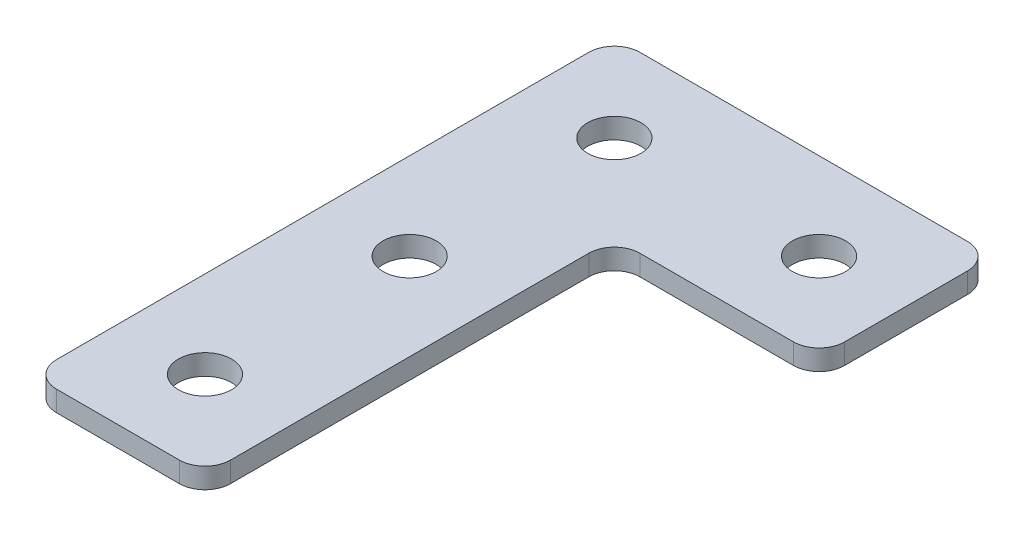
ISO-10303-21;
HEADER;
FILE_DESCRIPTION(('STEP AP214'),'2;1');
FILE_NAME('part.step','',(''),(''),'','','');
FILE_SCHEMA(('AUTOMOTIVE_DESIGN { 1 0 10303 214 1 1 1 1 }'));
ENDSEC;
DATA;
#1=APPLICATION_CONTEXT('core data for automotive mechanical design processes');
#2=APPLICATION_PROTOCOL_DEFINITION('international standard','automotive_design',2000,#1);
#3=PRODUCT_CONTEXT('',#1,'mechanical');
#4=PRODUCT('Part','Part','',(#3));
#5=PRODUCT_RELATED_PRODUCT_CATEGORY('part','',(#4));
#6=PRODUCT_DEFINITION_FORMATION('','',#4);
#7=PRODUCT_DEFINITION_CONTEXT('part definition',#1,'design');
#8=PRODUCT_DEFINITION('design','',#6,#7);
#9=PRODUCT_DEFINITION_SHAPE('','',#8);
#10=(LENGTH_UNIT() NAMED_UNIT(*) SI_UNIT(.MILLI.,.METRE.));
#11=(NAMED_UNIT(*) PLANE_ANGLE_UNIT() SI_UNIT($,.RADIAN.));
#12=(NAMED_UNIT(*) SI_UNIT($,.STERADIAN.) SOLID_ANGLE_UNIT());
#13=UNCERTAINTY_MEASURE_WITH_UNIT(LENGTH_MEASURE(1.E-05),#10,'distance_accuracy_value','');
#14=(GEOMETRIC_REPRESENTATION_CONTEXT(3) GLOBAL_UNCERTAINTY_ASSIGNED_CONTEXT((#13)) GLOBAL_UNIT_ASSIGNED_CONTEXT((#10,
#11,#12)) REPRESENTATION_CONTEXT('',''));
#15=CARTESIAN_POINT('',(0.,0.,0.));
#16=DIRECTION('',(0.,0.,1.));
#17=DIRECTION('',(1.,0.,0.));
#18=AXIS2_PLACEMENT_3D('',#15,#16,#17);
#19=CARTESIAN_POINT('',(-11.561814607669,1.92462627726309,-21.3623363744272));
#20=DIRECTION('',(0.,-1.,0.));
#21=DIRECTION('',(0.,0.,-1.));
#22=AXIS2_PLACEMENT_3D('',#19,#20,#21);
#23=PLANE('',#22);
#24=CARTESIAN_POINT('',(-11.561814607669,1.92462627726309,18.6376636255728));
#25=DIRECTION('',(0.,1.,0.));
#26=DIRECTION('',(0.,0.,1.));
#27=AXIS2_PLACEMENT_3D('',#24,#25,#26);
#28=CIRCLE('',#27,2.6);
#29=CARTESIAN_POINT('',(-11.561814607669,1.92462627726309,21.2376636255728));
#30=VERTEX_POINT('',#29);
#31=EDGE_CURVE('E323',#30,#30,#28,.T.);
#32=ORIENTED_EDGE('',*,*,#31,.T.);
#33=EDGE_LOOP('',(#32));
#34=FACE_BOUND('',#33,.T.);
#35=CARTESIAN_POINT('',(-11.561814607669,1.92462627726309,-1.36233637442724));
#36=DIRECTION('',(0.,1.,0.));
#37=DIRECTION('',(0.,0.,1.));
#38=AXIS2_PLACEMENT_3D('',#35,#36,#37);
#39=CIRCLE('',#38,2.6);
#40=CARTESIAN_POINT('',(-11.561814607669,1.92462627726309,1.23766362557276));
#41=VERTEX_POINT('',#40);
#42=EDGE_CURVE('E319',#41,#41,#39,.T.);
#43=ORIENTED_EDGE('',*,*,#42,.T.);
#44=EDGE_LOOP('',(#43));
#45=FACE_BOUND('',#44,.T.);
#46=CARTESIAN_POINT('',(8.43818539233104,1.92462627726309,-21.3623363744272));
#47=DIRECTION('',(0.,1.,0.));
#48=DIRECTION('',(0.,0.,1.));
#49=AXIS2_PLACEMENT_3D('',#46,#47,#48);
#50=CIRCLE('',#49,2.6);
#51=CARTESIAN_POINT('',(8.43818539233104,1.92462627726309,-18.7623363744272));
#52=VERTEX_POINT('',#51);
#53=EDGE_CURVE('E313',#52,#52,#50,.T.);
#54=ORIENTED_EDGE('',*,*,#53,.T.);
#55=EDGE_LOOP('',(#54));
#56=FACE_BOUND('',#55,.T.);
#57=CARTESIAN_POINT('',(-11.561814607669,1.92462627726309,-21.3623363744272));
#58=DIRECTION('',(0.,1.,0.));
#59=DIRECTION('',(0.,0.,1.));
#60=AXIS2_PLACEMENT_3D('',#57,#58,#59);
#61=CIRCLE('',#60,2.6);
#62=CARTESIAN_POINT('',(-11.561814607669,1.92462627726309,-18.7623363744272));
#63=VERTEX_POINT('',#62);
#64=EDGE_CURVE('E187',#63,#63,#61,.T.);
#65=ORIENTED_EDGE('',*,*,#64,.T.);
#66=EDGE_LOOP('',(#65));
#67=FACE_BOUND('',#66,.T.);
#68=DIRECTION('',(-1.,0.,0.));
#69=VECTOR('',#68,1.);
#70=CARTESIAN_POINT('',(16.938185392331,1.92462627726309,-29.8623363744273));
#71=LINE('',#70,#69);
#72=CARTESIAN_POINT('',(14.438185392331,1.92462627726309,-29.8623363744273));
#73=VERTEX_POINT('',#72);
#74=CARTESIAN_POINT('',(-17.561814607669,1.92462627726309,-29.8623363744273));
#75=VERTEX_POINT('',#74);
#76=EDGE_CURVE('E208',#73,#75,#71,.T.);
#77=ORIENTED_EDGE('',*,*,#76,.F.);
#78=CARTESIAN_POINT('',(14.438185392331,1.92462627726309,-27.3623363744273));
#79=DIRECTION('',(0.,-1.,0.));
#80=DIRECTION('',(0.,0.,-1.));
#81=AXIS2_PLACEMENT_3D('',#78,#79,#80);
#82=CIRCLE('',#81,2.5);
#83=CARTESIAN_POINT('',(16.938185392331,1.92462627726309,-27.3623363744273));
#84=VERTEX_POINT('',#83);
#85=EDGE_CURVE('E159',#73,#84,#82,.T.);
#86=ORIENTED_EDGE('',*,*,#85,.T.);
#87=DIRECTION('',(0.,0.,-1.));
#88=VECTOR('',#87,1.);
#89=CARTESIAN_POINT('',(16.938185392331,1.92462627726309,-12.8623363744272));
#90=LINE('',#89,#88);
#91=CARTESIAN_POINT('',(16.938185392331,1.92462627726309,-15.3623363744272));
#92=VERTEX_POINT('',#91);
#93=EDGE_CURVE('E217',#92,#84,#90,.T.);
#94=ORIENTED_EDGE('',*,*,#93,.F.);
#95=CARTESIAN_POINT('',(14.438185392331,1.92462627726309,-15.3623363744272));
#96=DIRECTION('',(0.,-1.,0.));
#97=DIRECTION('',(0.,0.,-1.));
#98=AXIS2_PLACEMENT_3D('',#95,#96,#97);
#99=CIRCLE('',#98,2.5);
#100=CARTESIAN_POINT('',(14.438185392331,1.92462627726309,-12.8623363744272));
#101=VERTEX_POINT('',#100);
#102=EDGE_CURVE('E131',#92,#101,#99,.T.);
#103=ORIENTED_EDGE('',*,*,#102,.T.);
#104=DIRECTION('',(1.,0.,0.));
#105=VECTOR('',#104,1.);
#106=CARTESIAN_POINT('',(-3.0618146076689,1.92462627726309,-12.8623363744272));
#107=LINE('',#106,#105);
#108=CARTESIAN_POINT('',(-0.561814607668902,1.92462627726309,-12.8623363744272));
#109=VERTEX_POINT('',#108);
#110=EDGE_CURVE('E194',#109,#101,#107,.T.);
#111=ORIENTED_EDGE('',*,*,#110,.F.);
#112=CARTESIAN_POINT('',(-0.561814607668902,1.92462627726309,-10.3623363744272));
#113=DIRECTION('',(0.,-1.,0.));
#114=DIRECTION('',(0.,0.,-1.));
#115=AXIS2_PLACEMENT_3D('',#112,#113,#114);
#116=CIRCLE('',#115,2.5);
#117=CARTESIAN_POINT('',(-3.0618146076689,1.92462627726309,-10.3623363744272));
#118=VERTEX_POINT('',#117);
#119=EDGE_CURVE('E10',#109,#118,#116,.F.);
#120=ORIENTED_EDGE('',*,*,#119,.T.);
#121=DIRECTION('',(0.,0.,-1.));
#122=VECTOR('',#121,1.);
#123=CARTESIAN_POINT('',(-3.0618146076689,1.92462627726309,27.1376636255727));
#124=LINE('',#123,#122);
#125=CARTESIAN_POINT('',(-3.0618146076689,1.92462627726309,24.6376636255727));
#126=VERTEX_POINT('',#125);
#127=EDGE_CURVE('E132',#126,#118,#124,.T.);
#128=ORIENTED_EDGE('',*,*,#127,.F.);
#129=CARTESIAN_POINT('',(-5.5618146076689,1.92462627726309,24.6376636255727));
#130=DIRECTION('',(0.,-1.,0.));
#131=DIRECTION('',(0.,0.,-1.));
#132=AXIS2_PLACEMENT_3D('',#129,#130,#131);
#133=CIRCLE('',#132,2.5);
#134=CARTESIAN_POINT('',(-5.5618146076689,1.92462627726309,27.1376636255727));
#135=VERTEX_POINT('',#134);
#136=EDGE_CURVE('E153',#126,#135,#133,.T.);
#137=ORIENTED_EDGE('',*,*,#136,.T.);
#138=DIRECTION('',(1.,0.,0.));
#139=VECTOR('',#138,1.);
#140=CARTESIAN_POINT('',(-20.061814607669,1.92462627726309,27.1376636255727));
#141=LINE('',#140,#139);
#142=CARTESIAN_POINT('',(-17.561814607669,1.92462627726309,27.1376636255727));
#143=VERTEX_POINT('',#142);
#144=EDGE_CURVE('E136',#143,#135,#141,.T.);
#145=ORIENTED_EDGE('',*,*,#144,.F.);
#146=CARTESIAN_POINT('',(-17.561814607669,1.92462627726309,24.6376636255727));
#147=DIRECTION('',(0.,-1.,0.));
#148=DIRECTION('',(0.,0.,-1.));
#149=AXIS2_PLACEMENT_3D('',#146,#147,#148);
#150=CIRCLE('',#149,2.5);
#151=CARTESIAN_POINT('',(-20.061814607669,1.92462627726309,24.6376636255727));
#152=VERTEX_POINT('',#151);
#153=EDGE_CURVE('E31',#143,#152,#150,.T.);
#154=ORIENTED_EDGE('',*,*,#153,.T.);
#155=DIRECTION('',(0.,0.,1.));
#156=VECTOR('',#155,1.);
#157=CARTESIAN_POINT('',(-20.061814607669,1.92462627726309,-29.8623363744273));
#158=LINE('',#157,#156);
#159=CARTESIAN_POINT('',(-20.061814607669,1.92462627726309,-27.3623363744273));
#160=VERTEX_POINT('',#159);
#161=EDGE_CURVE('E206',#160,#152,#158,.T.);
#162=ORIENTED_EDGE('',*,*,#161,.F.);
#163=CARTESIAN_POINT('',(-17.561814607669,1.92462627726309,-27.3623363744273));
#164=DIRECTION('',(0.,-1.,0.));
#165=DIRECTION('',(0.,0.,-1.));
#166=AXIS2_PLACEMENT_3D('',#163,#164,#165);
#167=CIRCLE('',#166,2.5);
#168=EDGE_CURVE('E157',#160,#75,#167,.T.);
#169=ORIENTED_EDGE('',*,*,#168,.T.);
#170=EDGE_LOOP('',(#77,#86,#94,#103,#111,#120,#128,#137,#145,#154,#162,#169));
#171=FACE_BOUND('',#170,.T.);
#172=ADVANCED_FACE('F16',(#34,#45,#56,#67,#171),#23,.T.);
#173=CARTESIAN_POINT('',(-3.0618146076689,1.92462627726309,-12.8623363744272));
#174=DIRECTION('',(0.,0.,1.));
#175=DIRECTION('',(1.,0.,0.));
#176=AXIS2_PLACEMENT_3D('',#173,#174,#175);
#177=PLANE('',#176);
#178=DIRECTION('',(1.,0.,0.));
#179=VECTOR('',#178,1.);
#180=CARTESIAN_POINT('',(-3.0618146076689,3.92462627726309,-12.8623363744272));
#181=LINE('',#180,#179);
#182=CARTESIAN_POINT('',(-0.561814607668902,3.92462627726309,-12.8623363744272));
#183=VERTEX_POINT('',#182);
#184=CARTESIAN_POINT('',(14.438185392331,3.92462627726309,-12.8623363744272));
#185=VERTEX_POINT('',#184);
#186=EDGE_CURVE('E111',#183,#185,#181,.T.);
#187=ORIENTED_EDGE('',*,*,#186,.F.);
#188=DIRECTION('',(0.,1.,0.));
#189=VECTOR('',#188,1.);
#190=CARTESIAN_POINT('',(-0.561814607668902,1.92462627726309,-12.8623363744272));
#191=LINE('',#190,#189);
#192=EDGE_CURVE('E177',#183,#109,#191,.F.);
#193=ORIENTED_EDGE('',*,*,#192,.T.);
#194=ORIENTED_EDGE('',*,*,#110,.T.);
#195=DIRECTION('',(0.,1.,0.));
#196=VECTOR('',#195,1.);
#197=CARTESIAN_POINT('',(14.438185392331,1.92462627726309,-12.8623363744272));
#198=LINE('',#197,#196);
#199=EDGE_CURVE('E175',#101,#185,#198,.T.);
#200=ORIENTED_EDGE('',*,*,#199,.T.);
#201=EDGE_LOOP('',(#187,#193,#194,#200));
#202=FACE_BOUND('',#201,.T.);
#203=ADVANCED_FACE('F184',(#202),#177,.T.);
#204=CARTESIAN_POINT('',(-3.0618146076689,1.92462627726309,27.1376636255727));
#205=DIRECTION('',(1.,0.,0.));
#206=DIRECTION('',(0.,0.,-1.));
#207=AXIS2_PLACEMENT_3D('',#204,#205,#206);
#208=PLANE('',#207);
#209=ORIENTED_EDGE('',*,*,#127,.T.);
#210=DIRECTION('',(0.,1.,0.));
#211=VECTOR('',#210,1.);
#212=CARTESIAN_POINT('',(-3.0618146076689,3.92462627726309,-10.3623363744272));
#213=LINE('',#212,#211);
#214=CARTESIAN_POINT('',(-3.0618146076689,3.92462627726309,-10.3623363744272));
#215=VERTEX_POINT('',#214);
#216=EDGE_CURVE('E172',#118,#215,#213,.T.);
#217=ORIENTED_EDGE('',*,*,#216,.T.);
#218=DIRECTION('',(0.,0.,-1.));
#219=VECTOR('',#218,1.);
#220=CARTESIAN_POINT('',(-3.0618146076689,3.92462627726309,27.1376636255727));
#221=LINE('',#220,#219);
#222=CARTESIAN_POINT('',(-3.0618146076689,3.92462627726309,24.6376636255727));
#223=VERTEX_POINT('',#222);
#224=EDGE_CURVE('E139',#223,#215,#221,.T.);
#225=ORIENTED_EDGE('',*,*,#224,.F.);
#226=DIRECTION('',(0.,1.,0.));
#227=VECTOR('',#226,1.);
#228=CARTESIAN_POINT('',(-3.0618146076689,1.92462627726309,24.6376636255727));
#229=LINE('',#228,#227);
#230=EDGE_CURVE('E170',#223,#126,#229,.F.);
#231=ORIENTED_EDGE('',*,*,#230,.T.);
#232=EDGE_LOOP('',(#209,#217,#225,#231));
#233=FACE_BOUND('',#232,.T.);
#234=ADVANCED_FACE('F196',(#233),#208,.T.);
#235=CARTESIAN_POINT('',(-20.061814607669,1.92462627726309,27.1376636255727));
#236=DIRECTION('',(0.,0.,1.));
#237=DIRECTION('',(1.,0.,0.));
#238=AXIS2_PLACEMENT_3D('',#235,#236,#237);
#239=PLANE('',#238);
#240=DIRECTION('',(1.,0.,0.));
#241=VECTOR('',#240,1.);
#242=CARTESIAN_POINT('',(-20.061814607669,3.92462627726309,27.1376636255727));
#243=LINE('',#242,#241);
#244=CARTESIAN_POINT('',(-17.561814607669,3.92462627726309,27.1376636255727));
#245=VERTEX_POINT('',#244);
#246=CARTESIAN_POINT('',(-5.5618146076689,3.92462627726309,27.1376636255727));
#247=VERTEX_POINT('',#246);
#248=EDGE_CURVE('E216',#245,#247,#243,.T.);
#249=ORIENTED_EDGE('',*,*,#248,.F.);
#250=DIRECTION('',(0.,1.,0.));
#251=VECTOR('',#250,1.);
#252=CARTESIAN_POINT('',(-17.561814607669,1.92462627726309,27.1376636255727));
#253=LINE('',#252,#251);
#254=EDGE_CURVE('E168',#245,#143,#253,.F.);
#255=ORIENTED_EDGE('',*,*,#254,.T.);
#256=ORIENTED_EDGE('',*,*,#144,.T.);
#257=DIRECTION('',(0.,1.,0.));
#258=VECTOR('',#257,1.);
#259=CARTESIAN_POINT('',(-5.5618146076689,1.92462627726309,27.1376636255727));
#260=LINE('',#259,#258);
#261=EDGE_CURVE('E165',#135,#247,#260,.T.);
#262=ORIENTED_EDGE('',*,*,#261,.T.);
#263=EDGE_LOOP('',(#249,#255,#256,#262));
#264=FACE_BOUND('',#263,.T.);
#265=ADVANCED_FACE('F203',(#264),#239,.T.);
#266=CARTESIAN_POINT('',(-20.061814607669,1.92462627726309,-29.8623363744273));
#267=DIRECTION('',(-1.,0.,0.));
#268=DIRECTION('',(0.,0.,1.));
#269=AXIS2_PLACEMENT_3D('',#266,#267,#268);
#270=PLANE('',#269);
#271=DIRECTION('',(0.,0.,1.));
#272=VECTOR('',#271,1.);
#273=CARTESIAN_POINT('',(-20.061814607669,3.92462627726309,-29.8623363744273));
#274=LINE('',#273,#272);
#275=CARTESIAN_POINT('',(-20.061814607669,3.92462627726309,-27.3623363744273));
#276=VERTEX_POINT('',#275);
#277=CARTESIAN_POINT('',(-20.061814607669,3.92462627726309,24.6376636255727));
#278=VERTEX_POINT('',#277);
#279=EDGE_CURVE('E214',#276,#278,#274,.T.);
#280=ORIENTED_EDGE('',*,*,#279,.F.);
#281=DIRECTION('',(0.,1.,0.));
#282=VECTOR('',#281,1.);
#283=CARTESIAN_POINT('',(-20.061814607669,1.92462627726309,-27.3623363744273));
#284=LINE('',#283,#282);
#285=EDGE_CURVE('E38',#276,#160,#284,.F.);
#286=ORIENTED_EDGE('',*,*,#285,.T.);
#287=ORIENTED_EDGE('',*,*,#161,.T.);
#288=DIRECTION('',(0.,1.,0.));
#289=VECTOR('',#288,1.);
#290=CARTESIAN_POINT('',(-20.061814607669,1.92462627726309,24.6376636255727));
#291=LINE('',#290,#289);
#292=EDGE_CURVE('E161',#152,#278,#291,.T.);
#293=ORIENTED_EDGE('',*,*,#292,.T.);
#294=EDGE_LOOP('',(#280,#286,#287,#293));
#295=FACE_BOUND('',#294,.T.);
#296=ADVANCED_FACE('F233',(#295),#270,.T.);
#297=CARTESIAN_POINT('',(16.938185392331,1.92462627726309,-29.8623363744273));
#298=DIRECTION('',(0.,0.,-1.));
#299=DIRECTION('',(-1.,0.,0.));
#300=AXIS2_PLACEMENT_3D('',#297,#298,#299);
#301=PLANE('',#300);
#302=DIRECTION('',(-1.,0.,0.));
#303=VECTOR('',#302,1.);
#304=CARTESIAN_POINT('',(16.938185392331,3.92462627726309,-29.8623363744273));
#305=LINE('',#304,#303);
#306=CARTESIAN_POINT('',(14.438185392331,3.92462627726309,-29.8623363744273));
#307=VERTEX_POINT('',#306);
#308=CARTESIAN_POINT('',(-17.561814607669,3.92462627726309,-29.8623363744273));
#309=VERTEX_POINT('',#308);
#310=EDGE_CURVE('E127',#307,#309,#305,.T.);
#311=ORIENTED_EDGE('',*,*,#310,.F.);
#312=DIRECTION('',(0.,1.,0.));
#313=VECTOR('',#312,1.);
#314=CARTESIAN_POINT('',(14.438185392331,1.92462627726309,-29.8623363744273));
#315=LINE('',#314,#313);
#316=EDGE_CURVE('E151',#307,#73,#315,.F.);
#317=ORIENTED_EDGE('',*,*,#316,.T.);
#318=ORIENTED_EDGE('',*,*,#76,.T.);
#319=DIRECTION('',(0.,1.,0.));
#320=VECTOR('',#319,1.);
#321=CARTESIAN_POINT('',(-17.561814607669,1.92462627726309,-29.8623363744273));
#322=LINE('',#321,#320);
#323=EDGE_CURVE('E148',#75,#309,#322,.T.);
#324=ORIENTED_EDGE('',*,*,#323,.T.);
#325=EDGE_LOOP('',(#311,#317,#318,#324));
#326=FACE_BOUND('',#325,.T.);
#327=ADVANCED_FACE('F227',(#326),#301,.T.);
#328=CARTESIAN_POINT('',(16.938185392331,1.92462627726309,-12.8623363744272));
#329=DIRECTION('',(1.,0.,0.));
#330=DIRECTION('',(0.,0.,-1.));
#331=AXIS2_PLACEMENT_3D('',#328,#329,#330);
#332=PLANE('',#331);
#333=ORIENTED_EDGE('',*,*,#93,.T.);
#334=DIRECTION('',(0.,1.,0.));
#335=VECTOR('',#334,1.);
#336=CARTESIAN_POINT('',(16.938185392331,1.92462627726309,-27.3623363744273));
#337=LINE('',#336,#335);
#338=CARTESIAN_POINT('',(16.938185392331,3.92462627726309,-27.3623363744273));
#339=VERTEX_POINT('',#338);
#340=EDGE_CURVE('E126',#84,#339,#337,.T.);
#341=ORIENTED_EDGE('',*,*,#340,.T.);
#342=DIRECTION('',(0.,0.,-1.));
#343=VECTOR('',#342,1.);
#344=CARTESIAN_POINT('',(16.938185392331,3.92462627726309,-12.8623363744272));
#345=LINE('',#344,#343);
#346=CARTESIAN_POINT('',(16.938185392331,3.92462627726309,-15.3623363744272));
#347=VERTEX_POINT('',#346);
#348=EDGE_CURVE('E109',#347,#339,#345,.T.);
#349=ORIENTED_EDGE('',*,*,#348,.F.);
#350=DIRECTION('',(0.,1.,0.));
#351=VECTOR('',#350,1.);
#352=CARTESIAN_POINT('',(16.938185392331,1.92462627726309,-15.3623363744272));
#353=LINE('',#352,#351);
#354=EDGE_CURVE('E123',#347,#92,#353,.F.);
#355=ORIENTED_EDGE('',*,*,#354,.T.);
#356=EDGE_LOOP('',(#333,#341,#349,#355));
#357=FACE_BOUND('',#356,.T.);
#358=ADVANCED_FACE('F122',(#357),#332,.T.);
#359=CARTESIAN_POINT('',(-11.561814607669,3.92462627726309,-21.3623363744272));
#360=DIRECTION('',(0.,-1.,0.));
#361=DIRECTION('',(0.,0.,-1.));
#362=AXIS2_PLACEMENT_3D('',#359,#360,#361);
#363=PLANE('',#362);
#364=CARTESIAN_POINT('',(-11.561814607669,3.92462627726309,18.6376636255728));
#365=DIRECTION('',(0.,1.,0.));
#366=DIRECTION('',(0.,0.,1.));
#367=AXIS2_PLACEMENT_3D('',#364,#365,#366);
#368=CIRCLE('',#367,2.6);
#369=CARTESIAN_POINT('',(-11.561814607669,3.92462627726309,21.2376636255728));
#370=VERTEX_POINT('',#369);
#371=EDGE_CURVE('E301',#370,#370,#368,.T.);
#372=ORIENTED_EDGE('',*,*,#371,.F.);
#373=EDGE_LOOP('',(#372));
#374=FACE_BOUND('',#373,.T.);
#375=CARTESIAN_POINT('',(-11.561814607669,3.92462627726309,-1.36233637442724));
#376=DIRECTION('',(0.,1.,0.));
#377=DIRECTION('',(0.,0.,1.));
#378=AXIS2_PLACEMENT_3D('',#375,#376,#377);
#379=CIRCLE('',#378,2.6);
#380=CARTESIAN_POINT('',(-11.561814607669,3.92462627726309,1.23766362557276));
#381=VERTEX_POINT('',#380);
#382=EDGE_CURVE('E305',#381,#381,#379,.T.);
#383=ORIENTED_EDGE('',*,*,#382,.F.);
#384=EDGE_LOOP('',(#383));
#385=FACE_BOUND('',#384,.T.);
#386=CARTESIAN_POINT('',(8.43818539233104,3.92462627726309,-21.3623363744272));
#387=DIRECTION('',(0.,1.,0.));
#388=DIRECTION('',(0.,0.,1.));
#389=AXIS2_PLACEMENT_3D('',#386,#387,#388);
#390=CIRCLE('',#389,2.6);
#391=CARTESIAN_POINT('',(8.43818539233104,3.92462627726309,-18.7623363744272));
#392=VERTEX_POINT('',#391);
#393=EDGE_CURVE('E309',#392,#392,#390,.T.);
#394=ORIENTED_EDGE('',*,*,#393,.F.);
#395=EDGE_LOOP('',(#394));
#396=FACE_BOUND('',#395,.T.);
#397=CARTESIAN_POINT('',(-11.561814607669,3.92462627726309,-21.3623363744272));
#398=DIRECTION('',(0.,1.,0.));
#399=DIRECTION('',(0.,0.,1.));
#400=AXIS2_PLACEMENT_3D('',#397,#398,#399);
#401=CIRCLE('',#400,2.6);
#402=CARTESIAN_POINT('',(-11.561814607669,3.92462627726309,-18.7623363744272));
#403=VERTEX_POINT('',#402);
#404=EDGE_CURVE('E221',#403,#403,#401,.T.);
#405=ORIENTED_EDGE('',*,*,#404,.F.);
#406=EDGE_LOOP('',(#405));
#407=FACE_BOUND('',#406,.T.);
#408=ORIENTED_EDGE('',*,*,#348,.T.);
#409=CARTESIAN_POINT('',(14.438185392331,3.92462627726309,-27.3623363744273));
#410=DIRECTION('',(0.,-1.,0.));
#411=DIRECTION('',(0.,0.,-1.));
#412=AXIS2_PLACEMENT_3D('',#409,#410,#411);
#413=CIRCLE('',#412,2.5);
#414=EDGE_CURVE('E146',#339,#307,#413,.F.);
#415=ORIENTED_EDGE('',*,*,#414,.T.);
#416=ORIENTED_EDGE('',*,*,#310,.T.);
#417=CARTESIAN_POINT('',(-17.561814607669,3.92462627726309,-27.3623363744273));
#418=DIRECTION('',(0.,-1.,0.));
#419=DIRECTION('',(0.,0.,-1.));
#420=AXIS2_PLACEMENT_3D('',#417,#418,#419);
#421=CIRCLE('',#420,2.5);
#422=EDGE_CURVE('E144',#309,#276,#421,.F.);
#423=ORIENTED_EDGE('',*,*,#422,.T.);
#424=ORIENTED_EDGE('',*,*,#279,.T.);
#425=CARTESIAN_POINT('',(-17.561814607669,3.92462627726309,24.6376636255727));
#426=DIRECTION('',(0.,-1.,0.));
#427=DIRECTION('',(0.,0.,-1.));
#428=AXIS2_PLACEMENT_3D('',#425,#426,#427);
#429=CIRCLE('',#428,2.5);
#430=EDGE_CURVE('E116',#278,#245,#429,.F.);
#431=ORIENTED_EDGE('',*,*,#430,.T.);
#432=ORIENTED_EDGE('',*,*,#248,.T.);
#433=CARTESIAN_POINT('',(-5.5618146076689,3.92462627726309,24.6376636255727));
#434=DIRECTION('',(0.,-1.,0.));
#435=DIRECTION('',(0.,0.,-1.));
#436=AXIS2_PLACEMENT_3D('',#433,#434,#435);
#437=CIRCLE('',#436,2.5);
#438=EDGE_CURVE('E117',#247,#223,#437,.F.);
#439=ORIENTED_EDGE('',*,*,#438,.T.);
#440=ORIENTED_EDGE('',*,*,#224,.T.);
#441=CARTESIAN_POINT('',(-0.561814607668902,3.92462627726309,-10.3623363744272));
#442=DIRECTION('',(0.,-1.,0.));
#443=DIRECTION('',(0.,0.,-1.));
#444=AXIS2_PLACEMENT_3D('',#441,#442,#443);
#445=CIRCLE('',#444,2.5);
#446=EDGE_CURVE('E24',#215,#183,#445,.T.);
#447=ORIENTED_EDGE('',*,*,#446,.T.);
#448=ORIENTED_EDGE('',*,*,#186,.T.);
#449=CARTESIAN_POINT('',(14.438185392331,3.92462627726309,-15.3623363744272));
#450=DIRECTION('',(0.,-1.,0.));
#451=DIRECTION('',(0.,0.,-1.));
#452=AXIS2_PLACEMENT_3D('',#449,#450,#451);
#453=CIRCLE('',#452,2.5);
#454=EDGE_CURVE('E106',#185,#347,#453,.F.);
#455=ORIENTED_EDGE('',*,*,#454,.T.);
#456=EDGE_LOOP('',(#408,#415,#416,#423,#424,#431,#432,#439,#440,#447,#448,#455));
#457=FACE_BOUND('',#456,.T.);
#458=ADVANCED_FACE('F108',(#374,#385,#396,#407,#457),#363,.F.);
#459=CARTESIAN_POINT('',(-11.561814607669,1.92462627726309,-21.3623363744272));
#460=DIRECTION('',(0.,1.,0.));
#461=DIRECTION('',(0.,0.,1.));
#462=AXIS2_PLACEMENT_3D('',#459,#460,#461);
#463=CYLINDRICAL_SURFACE('',#462,2.6);
#464=ORIENTED_EDGE('',*,*,#64,.F.);
#465=EDGE_LOOP('',(#464));
#466=FACE_BOUND('',#465,.T.);
#467=ORIENTED_EDGE('',*,*,#404,.T.);
#468=EDGE_LOOP('',(#467));
#469=FACE_BOUND('',#468,.T.);
#470=ADVANCED_FACE('F278',(#466,#469),#463,.F.);
#471=CARTESIAN_POINT('',(8.43818539233104,1.92462627726309,-21.3623363744272));
#472=DIRECTION('',(0.,1.,0.));
#473=DIRECTION('',(0.,0.,1.));
#474=AXIS2_PLACEMENT_3D('',#471,#472,#473);
#475=CYLINDRICAL_SURFACE('',#474,2.6);
#476=ORIENTED_EDGE('',*,*,#53,.F.);
#477=EDGE_LOOP('',(#476));
#478=FACE_BOUND('',#477,.T.);
#479=ORIENTED_EDGE('',*,*,#393,.T.);
#480=EDGE_LOOP('',(#479));
#481=FACE_BOUND('',#480,.T.);
#482=ADVANCED_FACE('F270',(#478,#481),#475,.F.);
#483=CARTESIAN_POINT('',(-11.561814607669,1.92462627726309,-1.36233637442724));
#484=DIRECTION('',(0.,1.,0.));
#485=DIRECTION('',(0.,0.,1.));
#486=AXIS2_PLACEMENT_3D('',#483,#484,#485);
#487=CYLINDRICAL_SURFACE('',#486,2.6);
#488=ORIENTED_EDGE('',*,*,#42,.F.);
#489=EDGE_LOOP('',(#488));
#490=FACE_BOUND('',#489,.T.);
#491=ORIENTED_EDGE('',*,*,#382,.T.);
#492=EDGE_LOOP('',(#491));
#493=FACE_BOUND('',#492,.T.);
#494=ADVANCED_FACE('F264',(#490,#493),#487,.F.);
#495=CARTESIAN_POINT('',(-11.561814607669,1.92462627726309,18.6376636255728));
#496=DIRECTION('',(0.,1.,0.));
#497=DIRECTION('',(0.,0.,1.));
#498=AXIS2_PLACEMENT_3D('',#495,#496,#497);
#499=CYLINDRICAL_SURFACE('',#498,2.6);
#500=ORIENTED_EDGE('',*,*,#31,.F.);
#501=EDGE_LOOP('',(#500));
#502=FACE_BOUND('',#501,.T.);
#503=ORIENTED_EDGE('',*,*,#371,.T.);
#504=EDGE_LOOP('',(#503));
#505=FACE_BOUND('',#504,.T.);
#506=ADVANCED_FACE('F259',(#502,#505),#499,.F.);
#507=CARTESIAN_POINT('',(14.438185392331,1.92462627726309,-27.3623363744273));
#508=DIRECTION('',(0.,1.,0.));
#509=DIRECTION('',(0.,0.,1.));
#510=AXIS2_PLACEMENT_3D('',#507,#508,#509);
#511=CYLINDRICAL_SURFACE('',#510,2.5);
#512=ORIENTED_EDGE('',*,*,#85,.F.);
#513=ORIENTED_EDGE('',*,*,#316,.F.);
#514=ORIENTED_EDGE('',*,*,#414,.F.);
#515=ORIENTED_EDGE('',*,*,#340,.F.);
#516=EDGE_LOOP('',(#512,#513,#514,#515));
#517=FACE_BOUND('',#516,.T.);
#518=ADVANCED_FACE('F245',(#517),#511,.T.);
#519=CARTESIAN_POINT('',(-17.561814607669,1.92462627726309,-27.3623363744273));
#520=DIRECTION('',(0.,1.,0.));
#521=DIRECTION('',(0.,0.,1.));
#522=AXIS2_PLACEMENT_3D('',#519,#520,#521);
#523=CYLINDRICAL_SURFACE('',#522,2.5);
#524=ORIENTED_EDGE('',*,*,#168,.F.);
#525=ORIENTED_EDGE('',*,*,#285,.F.);
#526=ORIENTED_EDGE('',*,*,#422,.F.);
#527=ORIENTED_EDGE('',*,*,#323,.F.);
#528=EDGE_LOOP('',(#524,#525,#526,#527));
#529=FACE_BOUND('',#528,.T.);
#530=ADVANCED_FACE('F232',(#529),#523,.T.);
#531=CARTESIAN_POINT('',(-17.561814607669,1.92462627726309,24.6376636255727));
#532=DIRECTION('',(0.,1.,0.));
#533=DIRECTION('',(0.,0.,1.));
#534=AXIS2_PLACEMENT_3D('',#531,#532,#533);
#535=CYLINDRICAL_SURFACE('',#534,2.5);
#536=ORIENTED_EDGE('',*,*,#153,.F.);
#537=ORIENTED_EDGE('',*,*,#254,.F.);
#538=ORIENTED_EDGE('',*,*,#430,.F.);
#539=ORIENTED_EDGE('',*,*,#292,.F.);
#540=EDGE_LOOP('',(#536,#537,#538,#539));
#541=FACE_BOUND('',#540,.T.);
#542=ADVANCED_FACE('F236',(#541),#535,.T.);
#543=CARTESIAN_POINT('',(-0.561814607668902,1.92462627726309,-10.3623363744272));
#544=DIRECTION('',(0.,-1.,0.));
#545=DIRECTION('',(0.,0.,-1.));
#546=AXIS2_PLACEMENT_3D('',#543,#544,#545);
#547=CYLINDRICAL_SURFACE('',#546,2.5);
#548=ORIENTED_EDGE('',*,*,#119,.F.);
#549=ORIENTED_EDGE('',*,*,#192,.F.);
#550=ORIENTED_EDGE('',*,*,#446,.F.);
#551=ORIENTED_EDGE('',*,*,#216,.F.);
#552=EDGE_LOOP('',(#548,#549,#550,#551));
#553=FACE_BOUND('',#552,.T.);
#554=ADVANCED_FACE('F190',(#553),#547,.F.);
#555=CARTESIAN_POINT('',(14.438185392331,1.92462627726309,-15.3623363744272));
#556=DIRECTION('',(0.,1.,0.));
#557=DIRECTION('',(0.,0.,1.));
#558=AXIS2_PLACEMENT_3D('',#555,#556,#557);
#559=CYLINDRICAL_SURFACE('',#558,2.5);
#560=ORIENTED_EDGE('',*,*,#102,.F.);
#561=ORIENTED_EDGE('',*,*,#354,.F.);
#562=ORIENTED_EDGE('',*,*,#454,.F.);
#563=ORIENTED_EDGE('',*,*,#199,.F.);
#564=EDGE_LOOP('',(#560,#561,#562,#563));
#565=FACE_BOUND('',#564,.T.);
#566=ADVANCED_FACE('F130',(#565),#559,.T.);
#567=CARTESIAN_POINT('',(-5.5618146076689,1.92462627726309,24.6376636255727));
#568=DIRECTION('',(0.,1.,0.));
#569=DIRECTION('',(0.,0.,1.));
#570=AXIS2_PLACEMENT_3D('',#567,#568,#569);
#571=CYLINDRICAL_SURFACE('',#570,2.5);
#572=ORIENTED_EDGE('',*,*,#136,.F.);
#573=ORIENTED_EDGE('',*,*,#230,.F.);
#574=ORIENTED_EDGE('',*,*,#438,.F.);
#575=ORIENTED_EDGE('',*,*,#261,.F.);
#576=EDGE_LOOP('',(#572,#573,#574,#575));
#577=FACE_BOUND('',#576,.T.);
#578=ADVANCED_FACE('F18',(#577),#571,.T.);
#579=CLOSED_SHELL('',(#172,#203,#234,#265,#296,#327,#358,#458,#470,#482,#494,#506,#518,#530,
#542,#554,#566,#578));
#580=MANIFOLD_SOLID_BREP('B1',#579);
#581=ADVANCED_BREP_SHAPE_REPRESENTATION('',(#18,#580),#14);
#582=SHAPE_DEFINITION_REPRESENTATION(#9,#581);
ENDSEC;
END-ISO-10303-21;
